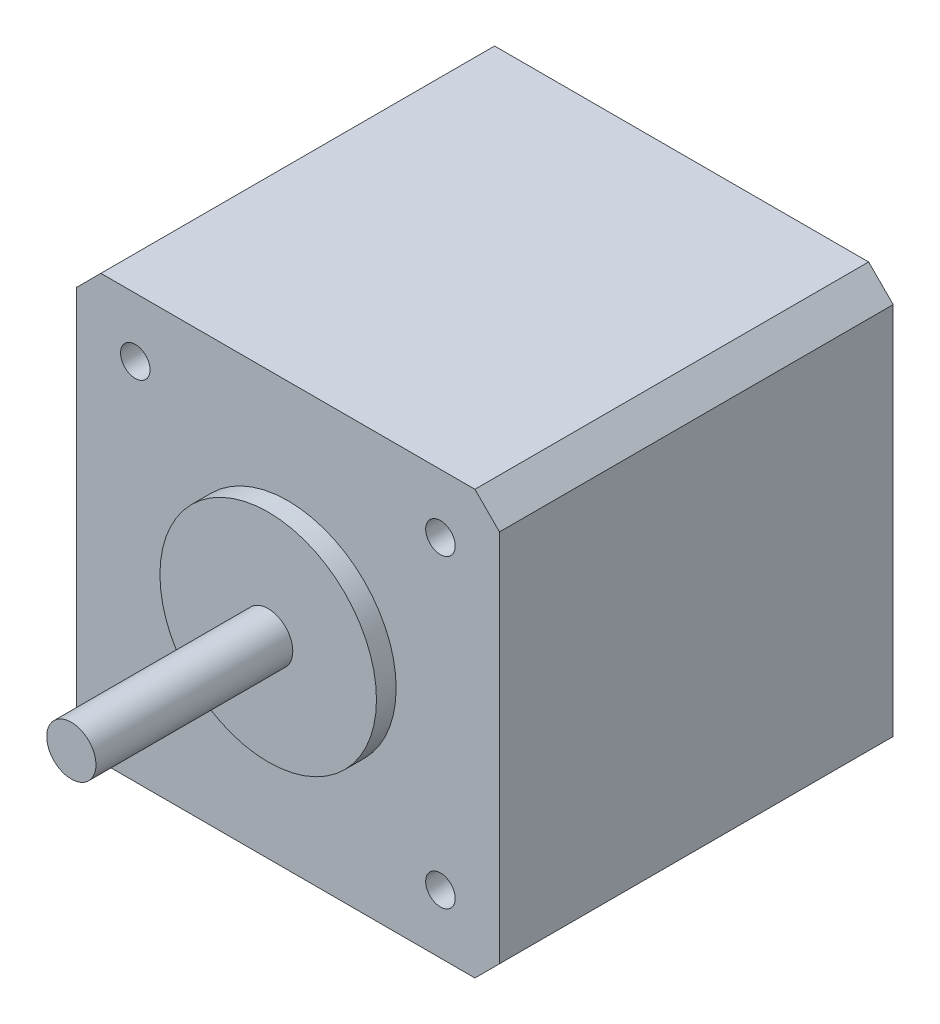
ISO-10303-21;
HEADER;
FILE_DESCRIPTION(('STEP AP214'),'2;1');
FILE_NAME('part.step','',(''),(''),'','','');
FILE_SCHEMA(('AUTOMOTIVE_DESIGN { 1 0 10303 214 1 1 1 1 }'));
ENDSEC;
DATA;
#1=APPLICATION_CONTEXT('core data for automotive mechanical design processes');
#2=APPLICATION_PROTOCOL_DEFINITION('international standard','automotive_design',2000,#1);
#3=PRODUCT_CONTEXT('',#1,'mechanical');
#4=PRODUCT('Part','Part','',(#3));
#5=PRODUCT_RELATED_PRODUCT_CATEGORY('part','',(#4));
#6=PRODUCT_DEFINITION_FORMATION('','',#4);
#7=PRODUCT_DEFINITION_CONTEXT('part definition',#1,'design');
#8=PRODUCT_DEFINITION('design','',#6,#7);
#9=PRODUCT_DEFINITION_SHAPE('','',#8);
#10=(LENGTH_UNIT() NAMED_UNIT(*) SI_UNIT(.MILLI.,.METRE.));
#11=(NAMED_UNIT(*) PLANE_ANGLE_UNIT() SI_UNIT($,.RADIAN.));
#12=(NAMED_UNIT(*) SI_UNIT($,.STERADIAN.) SOLID_ANGLE_UNIT());
#13=UNCERTAINTY_MEASURE_WITH_UNIT(LENGTH_MEASURE(1.E-05),#10,'distance_accuracy_value','');
#14=(GEOMETRIC_REPRESENTATION_CONTEXT(3) GLOBAL_UNCERTAINTY_ASSIGNED_CONTEXT((#13)) GLOBAL_UNIT_ASSIGNED_CONTEXT((#10,
#11,#12)) REPRESENTATION_CONTEXT('',''));
#15=CARTESIAN_POINT('',(0.,0.,0.));
#16=DIRECTION('',(0.,0.,1.));
#17=DIRECTION('',(1.,0.,0.));
#18=AXIS2_PLACEMENT_3D('',#15,#16,#17);
#19=CARTESIAN_POINT('',(0.,0.,42.));
#20=DIRECTION('',(0.,0.,1.));
#21=DIRECTION('',(1.,0.,0.));
#22=AXIS2_PLACEMENT_3D('',#19,#20,#21);
#23=PLANE('',#22);
#24=CARTESIAN_POINT('',(0.,0.,42.));
#25=DIRECTION('',(0.,0.,1.));
#26=DIRECTION('',(1.,0.,0.));
#27=AXIS2_PLACEMENT_3D('',#24,#25,#26);
#28=CIRCLE('',#27,11.);
#29=CARTESIAN_POINT('',(11.,0.,42.));
#30=VERTEX_POINT('',#29);
#31=EDGE_CURVE('E165',#30,#30,#28,.T.);
#32=ORIENTED_EDGE('',*,*,#31,.T.);
#33=EDGE_LOOP('',(#32));
#34=FACE_BOUND('',#33,.T.);
#35=CARTESIAN_POINT('',(0.,0.,42.));
#36=DIRECTION('',(0.,0.,1.));
#37=DIRECTION('',(1.,0.,0.));
#38=AXIS2_PLACEMENT_3D('',#35,#36,#37);
#39=CIRCLE('',#38,2.5);
#40=CARTESIAN_POINT('',(2.5,0.,42.));
#41=VERTEX_POINT('',#40);
#42=EDGE_CURVE('E176',#41,#41,#39,.T.);
#43=ORIENTED_EDGE('',*,*,#42,.F.);
#44=EDGE_LOOP('',(#43));
#45=FACE_BOUND('',#44,.T.);
#46=ADVANCED_FACE('F36',(#34,#45),#23,.T.);
#47=CARTESIAN_POINT('',(21.5,21.5,40.));
#48=DIRECTION('',(0.,0.,-1.));
#49=DIRECTION('',(-1.,0.,0.));
#50=AXIS2_PLACEMENT_3D('',#47,#48,#49);
#51=PLANE('',#50);
#52=CARTESIAN_POINT('',(-15.4999999999995,-15.5,40.));
#53=DIRECTION('',(0.,0.,1.));
#54=DIRECTION('',(1.,0.,0.));
#55=AXIS2_PLACEMENT_3D('',#52,#53,#54);
#56=CIRCLE('',#55,1.50000000000035);
#57=CARTESIAN_POINT('',(-13.9999999999992,-15.5,40.));
#58=VERTEX_POINT('',#57);
#59=EDGE_CURVE('E200',#58,#58,#56,.T.);
#60=ORIENTED_EDGE('',*,*,#59,.F.);
#61=EDGE_LOOP('',(#60));
#62=FACE_BOUND('',#61,.T.);
#63=CARTESIAN_POINT('',(15.5000000000005,-15.4999999999995,40.));
#64=DIRECTION('',(0.,0.,1.));
#65=DIRECTION('',(1.,0.,0.));
#66=AXIS2_PLACEMENT_3D('',#63,#64,#65);
#67=CIRCLE('',#66,1.50000000000035);
#68=CARTESIAN_POINT('',(17.0000000000008,-15.4999999999995,40.));
#69=VERTEX_POINT('',#68);
#70=EDGE_CURVE('E194',#69,#69,#67,.T.);
#71=ORIENTED_EDGE('',*,*,#70,.F.);
#72=EDGE_LOOP('',(#71));
#73=FACE_BOUND('',#72,.T.);
#74=CARTESIAN_POINT('',(15.5,15.5000000000005,40.));
#75=DIRECTION('',(0.,0.,1.));
#76=DIRECTION('',(1.,0.,0.));
#77=AXIS2_PLACEMENT_3D('',#74,#75,#76);
#78=CIRCLE('',#77,1.50000000000035);
#79=CARTESIAN_POINT('',(17.0000000000003,15.5000000000005,40.));
#80=VERTEX_POINT('',#79);
#81=EDGE_CURVE('E188',#80,#80,#78,.T.);
#82=ORIENTED_EDGE('',*,*,#81,.F.);
#83=EDGE_LOOP('',(#82));
#84=FACE_BOUND('',#83,.T.);
#85=CARTESIAN_POINT('',(-15.5,15.5,40.));
#86=DIRECTION('',(0.,0.,1.));
#87=DIRECTION('',(1.,0.,0.));
#88=AXIS2_PLACEMENT_3D('',#85,#86,#87);
#89=CIRCLE('',#88,1.50000000000035);
#90=CARTESIAN_POINT('',(-13.9999999999996,15.5,40.));
#91=VERTEX_POINT('',#90);
#92=EDGE_CURVE('E182',#91,#91,#89,.T.);
#93=ORIENTED_EDGE('',*,*,#92,.F.);
#94=EDGE_LOOP('',(#93));
#95=FACE_BOUND('',#94,.T.);
#96=DIRECTION('',(0.,-1.,0.));
#97=VECTOR('',#96,1.);
#98=CARTESIAN_POINT('',(-21.5,-21.5,40.));
#99=LINE('',#98,#97);
#100=CARTESIAN_POINT('',(-21.5,19.,40.));
#101=VERTEX_POINT('',#100);
#102=CARTESIAN_POINT('',(-21.5,-19.,40.));
#103=VERTEX_POINT('',#102);
#104=EDGE_CURVE('E169',#101,#103,#99,.T.);
#105=ORIENTED_EDGE('',*,*,#104,.T.);
#106=DIRECTION('',(-0.707106781186547,0.707106781186549,0.));
#107=VECTOR('',#106,1.);
#108=CARTESIAN_POINT('',(-19.,-21.5,40.));
#109=LINE('',#108,#107);
#110=CARTESIAN_POINT('',(-19.,-21.5,40.));
#111=VERTEX_POINT('',#110);
#112=EDGE_CURVE('E150',#103,#111,#109,.F.);
#113=ORIENTED_EDGE('',*,*,#112,.T.);
#114=DIRECTION('',(1.,0.,0.));
#115=VECTOR('',#114,1.);
#116=CARTESIAN_POINT('',(-21.5,-21.5,40.));
#117=LINE('',#116,#115);
#118=CARTESIAN_POINT('',(19.,-21.5,40.));
#119=VERTEX_POINT('',#118);
#120=EDGE_CURVE('E122',#111,#119,#117,.T.);
#121=ORIENTED_EDGE('',*,*,#120,.T.);
#122=DIRECTION('',(-0.707106781186549,-0.707106781186547,0.));
#123=VECTOR('',#122,1.);
#124=CARTESIAN_POINT('',(21.5,-19.,40.));
#125=LINE('',#124,#123);
#126=CARTESIAN_POINT('',(21.5,-19.,40.));
#127=VERTEX_POINT('',#126);
#128=EDGE_CURVE('E148',#119,#127,#125,.F.);
#129=ORIENTED_EDGE('',*,*,#128,.T.);
#130=DIRECTION('',(0.,1.,0.));
#131=VECTOR('',#130,1.);
#132=CARTESIAN_POINT('',(21.5,-21.5,40.));
#133=LINE('',#132,#131);
#134=CARTESIAN_POINT('',(21.5,19.,40.));
#135=VERTEX_POINT('',#134);
#136=EDGE_CURVE('E128',#127,#135,#133,.T.);
#137=ORIENTED_EDGE('',*,*,#136,.T.);
#138=DIRECTION('',(0.707106781186547,-0.707106781186549,0.));
#139=VECTOR('',#138,1.);
#140=CARTESIAN_POINT('',(19.,21.5,40.));
#141=LINE('',#140,#139);
#142=CARTESIAN_POINT('',(19.,21.5,40.));
#143=VERTEX_POINT('',#142);
#144=EDGE_CURVE('E57',#135,#143,#141,.F.);
#145=ORIENTED_EDGE('',*,*,#144,.T.);
#146=DIRECTION('',(-1.,0.,0.));
#147=VECTOR('',#146,1.);
#148=CARTESIAN_POINT('',(-21.5,21.5,40.));
#149=LINE('',#148,#147);
#150=CARTESIAN_POINT('',(-19.,21.5,40.));
#151=VERTEX_POINT('',#150);
#152=EDGE_CURVE('E131',#143,#151,#149,.T.);
#153=ORIENTED_EDGE('',*,*,#152,.T.);
#154=DIRECTION('',(0.707106781186549,0.707106781186547,0.));
#155=VECTOR('',#154,1.);
#156=CARTESIAN_POINT('',(-21.5,19.,40.));
#157=LINE('',#156,#155);
#158=EDGE_CURVE('E146',#151,#101,#157,.F.);
#159=ORIENTED_EDGE('',*,*,#158,.T.);
#160=EDGE_LOOP('',(#105,#113,#121,#129,#137,#145,#153,#159));
#161=FACE_BOUND('',#160,.T.);
#162=CARTESIAN_POINT('',(0.,0.,40.));
#163=DIRECTION('',(0.,0.,-1.));
#164=DIRECTION('',(-1.,0.,0.));
#165=AXIS2_PLACEMENT_3D('',#162,#163,#164);
#166=CIRCLE('',#165,11.);
#167=CARTESIAN_POINT('',(-11.,0.,40.));
#168=VERTEX_POINT('',#167);
#169=EDGE_CURVE('E11',#168,#168,#166,.F.);
#170=ORIENTED_EDGE('',*,*,#169,.F.);
#171=EDGE_LOOP('',(#170));
#172=FACE_BOUND('',#171,.T.);
#173=ADVANCED_FACE('F215',(#62,#73,#84,#95,#161,#172),#51,.F.);
#174=CARTESIAN_POINT('',(21.5,-21.5,40.));
#175=DIRECTION('',(-1.,0.,0.));
#176=DIRECTION('',(0.,0.,1.));
#177=AXIS2_PLACEMENT_3D('',#174,#175,#176);
#178=PLANE('',#177);
#179=ORIENTED_EDGE('',*,*,#136,.F.);
#180=DIRECTION('',(0.,0.,-1.));
#181=VECTOR('',#180,1.);
#182=CARTESIAN_POINT('',(21.5,-19.,40.));
#183=LINE('',#182,#181);
#184=CARTESIAN_POINT('',(21.5,-19.,0.));
#185=VERTEX_POINT('',#184);
#186=EDGE_CURVE('E154',#127,#185,#183,.T.);
#187=ORIENTED_EDGE('',*,*,#186,.T.);
#188=DIRECTION('',(0.,1.,0.));
#189=VECTOR('',#188,1.);
#190=CARTESIAN_POINT('',(21.5,-21.5,0.));
#191=LINE('',#190,#189);
#192=CARTESIAN_POINT('',(21.5,19.,0.));
#193=VERTEX_POINT('',#192);
#194=EDGE_CURVE('E164',#185,#193,#191,.T.);
#195=ORIENTED_EDGE('',*,*,#194,.T.);
#196=DIRECTION('',(0.,0.,1.));
#197=VECTOR('',#196,1.);
#198=CARTESIAN_POINT('',(21.5,19.,40.));
#199=LINE('',#198,#197);
#200=EDGE_CURVE('E152',#193,#135,#199,.T.);
#201=ORIENTED_EDGE('',*,*,#200,.T.);
#202=EDGE_LOOP('',(#179,#187,#195,#201));
#203=FACE_BOUND('',#202,.T.);
#204=ADVANCED_FACE('F218',(#203),#178,.F.);
#205=CARTESIAN_POINT('',(-21.5,21.5,40.));
#206=DIRECTION('',(0.,-1.,0.));
#207=DIRECTION('',(0.,0.,-1.));
#208=AXIS2_PLACEMENT_3D('',#205,#206,#207);
#209=PLANE('',#208);
#210=DIRECTION('',(-1.,0.,0.));
#211=VECTOR('',#210,1.);
#212=CARTESIAN_POINT('',(-21.5,21.5,0.));
#213=LINE('',#212,#211);
#214=CARTESIAN_POINT('',(19.,21.5,0.));
#215=VERTEX_POINT('',#214);
#216=CARTESIAN_POINT('',(-19.,21.5,0.));
#217=VERTEX_POINT('',#216);
#218=EDGE_CURVE('E133',#215,#217,#213,.T.);
#219=ORIENTED_EDGE('',*,*,#218,.T.);
#220=DIRECTION('',(0.,0.,1.));
#221=VECTOR('',#220,1.);
#222=CARTESIAN_POINT('',(-19.,21.5,40.));
#223=LINE('',#222,#221);
#224=EDGE_CURVE('E44',#217,#151,#223,.T.);
#225=ORIENTED_EDGE('',*,*,#224,.T.);
#226=ORIENTED_EDGE('',*,*,#152,.F.);
#227=DIRECTION('',(0.,0.,-1.));
#228=VECTOR('',#227,1.);
#229=CARTESIAN_POINT('',(19.,21.5,40.));
#230=LINE('',#229,#228);
#231=EDGE_CURVE('E157',#143,#215,#230,.T.);
#232=ORIENTED_EDGE('',*,*,#231,.T.);
#233=EDGE_LOOP('',(#219,#225,#226,#232));
#234=FACE_BOUND('',#233,.T.);
#235=ADVANCED_FACE('F161',(#234),#209,.F.);
#236=CARTESIAN_POINT('',(-21.5,-21.5,40.));
#237=DIRECTION('',(1.,0.,0.));
#238=DIRECTION('',(0.,0.,-1.));
#239=AXIS2_PLACEMENT_3D('',#236,#237,#238);
#240=PLANE('',#239);
#241=DIRECTION('',(0.,-1.,0.));
#242=VECTOR('',#241,1.);
#243=CARTESIAN_POINT('',(-21.5,-21.5,0.));
#244=LINE('',#243,#242);
#245=CARTESIAN_POINT('',(-21.5,19.,0.));
#246=VERTEX_POINT('',#245);
#247=CARTESIAN_POINT('',(-21.5,-19.,0.));
#248=VERTEX_POINT('',#247);
#249=EDGE_CURVE('E129',#246,#248,#244,.T.);
#250=ORIENTED_EDGE('',*,*,#249,.T.);
#251=DIRECTION('',(0.,0.,1.));
#252=VECTOR('',#251,1.);
#253=CARTESIAN_POINT('',(-21.5,-19.,40.));
#254=LINE('',#253,#252);
#255=EDGE_CURVE('E107',#248,#103,#254,.T.);
#256=ORIENTED_EDGE('',*,*,#255,.T.);
#257=ORIENTED_EDGE('',*,*,#104,.F.);
#258=DIRECTION('',(0.,0.,-1.));
#259=VECTOR('',#258,1.);
#260=CARTESIAN_POINT('',(-21.5,19.,40.));
#261=LINE('',#260,#259);
#262=EDGE_CURVE('E112',#101,#246,#261,.T.);
#263=ORIENTED_EDGE('',*,*,#262,.T.);
#264=EDGE_LOOP('',(#250,#256,#257,#263));
#265=FACE_BOUND('',#264,.T.);
#266=ADVANCED_FACE('F341',(#265),#240,.F.);
#267=CARTESIAN_POINT('',(-21.5,-21.5,40.));
#268=DIRECTION('',(0.,1.,0.));
#269=DIRECTION('',(0.,0.,1.));
#270=AXIS2_PLACEMENT_3D('',#267,#268,#269);
#271=PLANE('',#270);
#272=ORIENTED_EDGE('',*,*,#120,.F.);
#273=DIRECTION('',(0.,0.,-1.));
#274=VECTOR('',#273,1.);
#275=CARTESIAN_POINT('',(-19.,-21.5,40.));
#276=LINE('',#275,#274);
#277=CARTESIAN_POINT('',(-19.,-21.5,0.));
#278=VERTEX_POINT('',#277);
#279=EDGE_CURVE('E106',#111,#278,#276,.T.);
#280=ORIENTED_EDGE('',*,*,#279,.T.);
#281=DIRECTION('',(1.,0.,0.));
#282=VECTOR('',#281,1.);
#283=CARTESIAN_POINT('',(-21.5,-21.5,0.));
#284=LINE('',#283,#282);
#285=CARTESIAN_POINT('',(19.,-21.5,0.));
#286=VERTEX_POINT('',#285);
#287=EDGE_CURVE('E119',#278,#286,#284,.T.);
#288=ORIENTED_EDGE('',*,*,#287,.T.);
#289=DIRECTION('',(0.,0.,1.));
#290=VECTOR('',#289,1.);
#291=CARTESIAN_POINT('',(19.,-21.5,40.));
#292=LINE('',#291,#290);
#293=EDGE_CURVE('E124',#286,#119,#292,.T.);
#294=ORIENTED_EDGE('',*,*,#293,.T.);
#295=EDGE_LOOP('',(#272,#280,#288,#294));
#296=FACE_BOUND('',#295,.T.);
#297=ADVANCED_FACE('F118',(#296),#271,.F.);
#298=CARTESIAN_POINT('',(21.5,21.5,0.));
#299=DIRECTION('',(0.,0.,-1.));
#300=DIRECTION('',(-1.,0.,0.));
#301=AXIS2_PLACEMENT_3D('',#298,#299,#300);
#302=PLANE('',#301);
#303=ORIENTED_EDGE('',*,*,#287,.F.);
#304=DIRECTION('',(0.707106781186547,-0.707106781186549,0.));
#305=VECTOR('',#304,1.);
#306=CARTESIAN_POINT('',(-20.2500000000001,-20.2499999999999,0.));
#307=LINE('',#306,#305);
#308=EDGE_CURVE('E102',#278,#248,#307,.F.);
#309=ORIENTED_EDGE('',*,*,#308,.T.);
#310=ORIENTED_EDGE('',*,*,#249,.F.);
#311=DIRECTION('',(-0.707106781186549,-0.707106781186547,0.));
#312=VECTOR('',#311,1.);
#313=CARTESIAN_POINT('',(1.25000000000005,41.75,0.));
#314=LINE('',#313,#312);
#315=EDGE_CURVE('E139',#246,#217,#314,.F.);
#316=ORIENTED_EDGE('',*,*,#315,.T.);
#317=ORIENTED_EDGE('',*,*,#218,.F.);
#318=DIRECTION('',(-0.707106781186547,0.707106781186549,0.));
#319=VECTOR('',#318,1.);
#320=CARTESIAN_POINT('',(20.25,20.25,0.));
#321=LINE('',#320,#319);
#322=EDGE_CURVE('E123',#215,#193,#321,.F.);
#323=ORIENTED_EDGE('',*,*,#322,.T.);
#324=ORIENTED_EDGE('',*,*,#194,.F.);
#325=DIRECTION('',(0.707106781186549,0.707106781186547,0.));
#326=VECTOR('',#325,1.);
#327=CARTESIAN_POINT('',(41.75,1.24999999999994,0.));
#328=LINE('',#327,#326);
#329=EDGE_CURVE('E113',#185,#286,#328,.F.);
#330=ORIENTED_EDGE('',*,*,#329,.T.);
#331=EDGE_LOOP('',(#303,#309,#310,#316,#317,#323,#324,#330));
#332=FACE_BOUND('',#331,.T.);
#333=ADVANCED_FACE('F126',(#332),#302,.T.);
#334=CARTESIAN_POINT('',(-19.,-21.5,40.));
#335=DIRECTION('',(0.707106781186548,0.707106781186546,0.));
#336=DIRECTION('',(-0.707106781186547,0.707106781186549,0.));
#337=AXIS2_PLACEMENT_3D('',#334,#335,#336);
#338=PLANE('',#337);
#339=ORIENTED_EDGE('',*,*,#112,.F.);
#340=ORIENTED_EDGE('',*,*,#255,.F.);
#341=ORIENTED_EDGE('',*,*,#308,.F.);
#342=ORIENTED_EDGE('',*,*,#279,.F.);
#343=EDGE_LOOP('',(#339,#340,#341,#342));
#344=FACE_BOUND('',#343,.T.);
#345=ADVANCED_FACE('F105',(#344),#338,.F.);
#346=CARTESIAN_POINT('',(21.5,-19.,40.));
#347=DIRECTION('',(-0.707106781186546,0.707106781186548,0.));
#348=DIRECTION('',(-0.707106781186549,-0.707106781186547,0.));
#349=AXIS2_PLACEMENT_3D('',#346,#347,#348);
#350=PLANE('',#349);
#351=ORIENTED_EDGE('',*,*,#128,.F.);
#352=ORIENTED_EDGE('',*,*,#293,.F.);
#353=ORIENTED_EDGE('',*,*,#329,.F.);
#354=ORIENTED_EDGE('',*,*,#186,.F.);
#355=EDGE_LOOP('',(#351,#352,#353,#354));
#356=FACE_BOUND('',#355,.T.);
#357=ADVANCED_FACE('F368',(#356),#350,.F.);
#358=CARTESIAN_POINT('',(-21.5,19.,40.));
#359=DIRECTION('',(0.707106781186546,-0.707106781186548,0.));
#360=DIRECTION('',(0.707106781186549,0.707106781186547,0.));
#361=AXIS2_PLACEMENT_3D('',#358,#359,#360);
#362=PLANE('',#361);
#363=ORIENTED_EDGE('',*,*,#158,.F.);
#364=ORIENTED_EDGE('',*,*,#224,.F.);
#365=ORIENTED_EDGE('',*,*,#315,.F.);
#366=ORIENTED_EDGE('',*,*,#262,.F.);
#367=EDGE_LOOP('',(#363,#364,#365,#366));
#368=FACE_BOUND('',#367,.T.);
#369=ADVANCED_FACE('F241',(#368),#362,.F.);
#370=CARTESIAN_POINT('',(19.,21.5,40.));
#371=DIRECTION('',(-0.707106781186548,-0.707106781186546,0.));
#372=DIRECTION('',(0.707106781186547,-0.707106781186549,0.));
#373=AXIS2_PLACEMENT_3D('',#370,#371,#372);
#374=PLANE('',#373);
#375=ORIENTED_EDGE('',*,*,#144,.F.);
#376=ORIENTED_EDGE('',*,*,#200,.F.);
#377=ORIENTED_EDGE('',*,*,#322,.F.);
#378=ORIENTED_EDGE('',*,*,#231,.F.);
#379=EDGE_LOOP('',(#375,#376,#377,#378));
#380=FACE_BOUND('',#379,.T.);
#381=ADVANCED_FACE('F38',(#380),#374,.F.);
#382=CARTESIAN_POINT('',(0.,0.,42.));
#383=DIRECTION('',(0.,0.,-1.));
#384=DIRECTION('',(-1.,0.,0.));
#385=AXIS2_PLACEMENT_3D('',#382,#383,#384);
#386=CYLINDRICAL_SURFACE('',#385,11.);
#387=ORIENTED_EDGE('',*,*,#31,.F.);
#388=EDGE_LOOP('',(#387));
#389=FACE_BOUND('',#388,.T.);
#390=ORIENTED_EDGE('',*,*,#169,.T.);
#391=EDGE_LOOP('',(#390));
#392=FACE_BOUND('',#391,.T.);
#393=ADVANCED_FACE('F229',(#389,#392),#386,.T.);
#394=CARTESIAN_POINT('',(0.,0.,62.));
#395=DIRECTION('',(0.,0.,-1.));
#396=DIRECTION('',(-1.,0.,0.));
#397=AXIS2_PLACEMENT_3D('',#394,#395,#396);
#398=CYLINDRICAL_SURFACE('',#397,2.5);
#399=CARTESIAN_POINT('',(0.,0.,62.));
#400=DIRECTION('',(0.,0.,1.));
#401=DIRECTION('',(1.,0.,0.));
#402=AXIS2_PLACEMENT_3D('',#399,#400,#401);
#403=CIRCLE('',#402,2.5);
#404=CARTESIAN_POINT('',(2.5,0.,62.));
#405=VERTEX_POINT('',#404);
#406=EDGE_CURVE('E175',#405,#405,#403,.T.);
#407=ORIENTED_EDGE('',*,*,#406,.F.);
#408=EDGE_LOOP('',(#407));
#409=FACE_BOUND('',#408,.T.);
#410=ORIENTED_EDGE('',*,*,#42,.T.);
#411=EDGE_LOOP('',(#410));
#412=FACE_BOUND('',#411,.T.);
#413=ADVANCED_FACE('F231',(#409,#412),#398,.T.);
#414=CARTESIAN_POINT('',(0.,0.,62.));
#415=DIRECTION('',(0.,0.,1.));
#416=DIRECTION('',(1.,0.,0.));
#417=AXIS2_PLACEMENT_3D('',#414,#415,#416);
#418=PLANE('',#417);
#419=ORIENTED_EDGE('',*,*,#406,.T.);
#420=EDGE_LOOP('',(#419));
#421=FACE_BOUND('',#420,.T.);
#422=ADVANCED_FACE('F238',(#421),#418,.T.);
#423=CARTESIAN_POINT('',(-15.5,15.5,30.));
#424=DIRECTION('',(0.,0.,1.));
#425=DIRECTION('',(1.,0.,0.));
#426=AXIS2_PLACEMENT_3D('',#423,#424,#425);
#427=CYLINDRICAL_SURFACE('',#426,1.50000000000035);
#428=CARTESIAN_POINT('',(-15.5,15.5,30.));
#429=DIRECTION('',(0.,0.,1.));
#430=DIRECTION('',(1.,0.,0.));
#431=AXIS2_PLACEMENT_3D('',#428,#429,#430);
#432=CIRCLE('',#431,1.50000000000035);
#433=CARTESIAN_POINT('',(-13.9999999999996,15.5,30.));
#434=VERTEX_POINT('',#433);
#435=EDGE_CURVE('E179',#434,#434,#432,.T.);
#436=ORIENTED_EDGE('',*,*,#435,.F.);
#437=EDGE_LOOP('',(#436));
#438=FACE_BOUND('',#437,.T.);
#439=ORIENTED_EDGE('',*,*,#92,.T.);
#440=EDGE_LOOP('',(#439));
#441=FACE_BOUND('',#440,.T.);
#442=ADVANCED_FACE('F252',(#438,#441),#427,.F.);
#443=CARTESIAN_POINT('',(-15.5,15.5,30.));
#444=DIRECTION('',(0.,0.,1.));
#445=DIRECTION('',(1.,0.,0.));
#446=AXIS2_PLACEMENT_3D('',#443,#444,#445);
#447=PLANE('',#446);
#448=ORIENTED_EDGE('',*,*,#435,.T.);
#449=EDGE_LOOP('',(#448));
#450=FACE_BOUND('',#449,.T.);
#451=ADVANCED_FACE('F256',(#450),#447,.T.);
#452=CARTESIAN_POINT('',(15.5,15.5000000000005,30.));
#453=DIRECTION('',(0.,0.,1.));
#454=DIRECTION('',(1.,0.,0.));
#455=AXIS2_PLACEMENT_3D('',#452,#453,#454);
#456=CYLINDRICAL_SURFACE('',#455,1.50000000000035);
#457=CARTESIAN_POINT('',(15.5,15.5000000000005,30.));
#458=DIRECTION('',(0.,0.,1.));
#459=DIRECTION('',(1.,0.,0.));
#460=AXIS2_PLACEMENT_3D('',#457,#458,#459);
#461=CIRCLE('',#460,1.50000000000035);
#462=CARTESIAN_POINT('',(17.0000000000003,15.5000000000005,30.));
#463=VERTEX_POINT('',#462);
#464=EDGE_CURVE('E185',#463,#463,#461,.T.);
#465=ORIENTED_EDGE('',*,*,#464,.F.);
#466=EDGE_LOOP('',(#465));
#467=FACE_BOUND('',#466,.T.);
#468=ORIENTED_EDGE('',*,*,#81,.T.);
#469=EDGE_LOOP('',(#468));
#470=FACE_BOUND('',#469,.T.);
#471=ADVANCED_FACE('F260',(#467,#470),#456,.F.);
#472=CARTESIAN_POINT('',(15.5,15.5000000000005,30.));
#473=DIRECTION('',(0.,0.,1.));
#474=DIRECTION('',(1.,0.,0.));
#475=AXIS2_PLACEMENT_3D('',#472,#473,#474);
#476=PLANE('',#475);
#477=ORIENTED_EDGE('',*,*,#464,.T.);
#478=EDGE_LOOP('',(#477));
#479=FACE_BOUND('',#478,.T.);
#480=ADVANCED_FACE('F264',(#479),#476,.T.);
#481=CARTESIAN_POINT('',(15.5000000000005,-15.4999999999995,30.));
#482=DIRECTION('',(0.,0.,1.));
#483=DIRECTION('',(1.,0.,0.));
#484=AXIS2_PLACEMENT_3D('',#481,#482,#483);
#485=CYLINDRICAL_SURFACE('',#484,1.50000000000035);
#486=CARTESIAN_POINT('',(15.5000000000005,-15.4999999999995,30.));
#487=DIRECTION('',(0.,0.,1.));
#488=DIRECTION('',(1.,0.,0.));
#489=AXIS2_PLACEMENT_3D('',#486,#487,#488);
#490=CIRCLE('',#489,1.50000000000035);
#491=CARTESIAN_POINT('',(17.0000000000008,-15.4999999999995,30.));
#492=VERTEX_POINT('',#491);
#493=EDGE_CURVE('E191',#492,#492,#490,.T.);
#494=ORIENTED_EDGE('',*,*,#493,.F.);
#495=EDGE_LOOP('',(#494));
#496=FACE_BOUND('',#495,.T.);
#497=ORIENTED_EDGE('',*,*,#70,.T.);
#498=EDGE_LOOP('',(#497));
#499=FACE_BOUND('',#498,.T.);
#500=ADVANCED_FACE('F268',(#496,#499),#485,.F.);
#501=CARTESIAN_POINT('',(15.5000000000005,-15.4999999999995,30.));
#502=DIRECTION('',(0.,0.,1.));
#503=DIRECTION('',(1.,0.,0.));
#504=AXIS2_PLACEMENT_3D('',#501,#502,#503);
#505=PLANE('',#504);
#506=ORIENTED_EDGE('',*,*,#493,.T.);
#507=EDGE_LOOP('',(#506));
#508=FACE_BOUND('',#507,.T.);
#509=ADVANCED_FACE('F211',(#508),#505,.T.);
#510=CARTESIAN_POINT('',(-15.4999999999995,-15.5,30.));
#511=DIRECTION('',(0.,0.,1.));
#512=DIRECTION('',(1.,0.,0.));
#513=AXIS2_PLACEMENT_3D('',#510,#511,#512);
#514=CYLINDRICAL_SURFACE('',#513,1.50000000000035);
#515=CARTESIAN_POINT('',(-15.4999999999995,-15.5,30.));
#516=DIRECTION('',(0.,0.,1.));
#517=DIRECTION('',(1.,0.,0.));
#518=AXIS2_PLACEMENT_3D('',#515,#516,#517);
#519=CIRCLE('',#518,1.50000000000035);
#520=CARTESIAN_POINT('',(-13.9999999999992,-15.5,30.));
#521=VERTEX_POINT('',#520);
#522=EDGE_CURVE('E197',#521,#521,#519,.T.);
#523=ORIENTED_EDGE('',*,*,#522,.F.);
#524=EDGE_LOOP('',(#523));
#525=FACE_BOUND('',#524,.T.);
#526=ORIENTED_EDGE('',*,*,#59,.T.);
#527=EDGE_LOOP('',(#526));
#528=FACE_BOUND('',#527,.T.);
#529=ADVANCED_FACE('F208',(#525,#528),#514,.F.);
#530=CARTESIAN_POINT('',(-15.4999999999995,-15.5,30.));
#531=DIRECTION('',(0.,0.,1.));
#532=DIRECTION('',(1.,0.,0.));
#533=AXIS2_PLACEMENT_3D('',#530,#531,#532);
#534=PLANE('',#533);
#535=ORIENTED_EDGE('',*,*,#522,.T.);
#536=EDGE_LOOP('',(#535));
#537=FACE_BOUND('',#536,.T.);
#538=ADVANCED_FACE('F206',(#537),#534,.T.);
#539=CLOSED_SHELL('',(#46,#173,#204,#235,#266,#297,#333,#345,#357,#369,#381,#393,#413,#422,#442,
#451,#471,#480,#500,#509,#529,#538));
#540=MANIFOLD_SOLID_BREP('B2',#539);
#541=ADVANCED_BREP_SHAPE_REPRESENTATION('',(#18,#540),#14);
#542=SHAPE_DEFINITION_REPRESENTATION(#9,#541);
ENDSEC;
END-ISO-10303-21;
